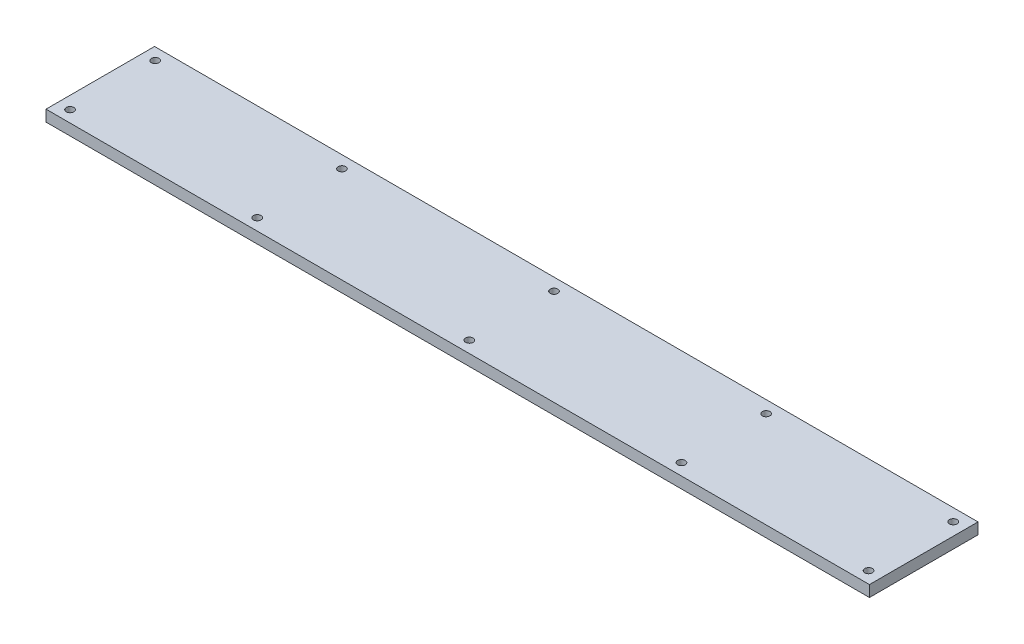
ISO-10303-21;
HEADER;
FILE_DESCRIPTION(('STEP AP214'),'2;1');
FILE_NAME('part.step','',(''),(''),'','','');
FILE_SCHEMA(('AUTOMOTIVE_DESIGN { 1 0 10303 214 1 1 1 1 }'));
ENDSEC;
DATA;
#1=APPLICATION_CONTEXT('core data for automotive mechanical design processes');
#2=APPLICATION_PROTOCOL_DEFINITION('international standard','automotive_design',2000,#1);
#3=PRODUCT_CONTEXT('',#1,'mechanical');
#4=PRODUCT('Part','Part','',(#3));
#5=PRODUCT_RELATED_PRODUCT_CATEGORY('part','',(#4));
#6=PRODUCT_DEFINITION_FORMATION('','',#4);
#7=PRODUCT_DEFINITION_CONTEXT('part definition',#1,'design');
#8=PRODUCT_DEFINITION('design','',#6,#7);
#9=PRODUCT_DEFINITION_SHAPE('','',#8);
#10=(LENGTH_UNIT() NAMED_UNIT(*) SI_UNIT(.MILLI.,.METRE.));
#11=(NAMED_UNIT(*) PLANE_ANGLE_UNIT() SI_UNIT($,.RADIAN.));
#12=(NAMED_UNIT(*) SI_UNIT($,.STERADIAN.) SOLID_ANGLE_UNIT());
#13=UNCERTAINTY_MEASURE_WITH_UNIT(LENGTH_MEASURE(1.E-05),#10,'distance_accuracy_value','');
#14=(GEOMETRIC_REPRESENTATION_CONTEXT(3) GLOBAL_UNCERTAINTY_ASSIGNED_CONTEXT((#13)) GLOBAL_UNIT_ASSIGNED_CONTEXT((#10,
#11,#12)) REPRESENTATION_CONTEXT('',''));
#15=CARTESIAN_POINT('',(0.,0.,0.));
#16=DIRECTION('',(0.,0.,1.));
#17=DIRECTION('',(1.,0.,0.));
#18=AXIS2_PLACEMENT_3D('',#15,#16,#17);
#19=CARTESIAN_POINT('',(0.,4.5,0.));
#20=DIRECTION('',(-1.,0.,0.));
#21=DIRECTION('',(0.,0.,1.));
#22=AXIS2_PLACEMENT_3D('',#19,#20,#21);
#23=PLANE('',#22);
#24=DIRECTION('',(0.,0.,-1.));
#25=VECTOR('',#24,1.);
#26=CARTESIAN_POINT('',(0.,0.,0.));
#27=LINE('',#26,#25);
#28=CARTESIAN_POINT('',(0.,0.,0.));
#29=VERTEX_POINT('',#28);
#30=CARTESIAN_POINT('',(0.,0.,-43.5));
#31=VERTEX_POINT('',#30);
#32=EDGE_CURVE('E100',#29,#31,#27,.T.);
#33=ORIENTED_EDGE('',*,*,#32,.T.);
#34=DIRECTION('',(0.,-1.,0.));
#35=VECTOR('',#34,1.);
#36=CARTESIAN_POINT('',(0.,4.5,-43.5));
#37=LINE('',#36,#35);
#38=CARTESIAN_POINT('',(0.,4.5,-43.5));
#39=VERTEX_POINT('',#38);
#40=EDGE_CURVE('E11',#39,#31,#37,.T.);
#41=ORIENTED_EDGE('',*,*,#40,.F.);
#42=DIRECTION('',(0.,0.,-1.));
#43=VECTOR('',#42,1.);
#44=CARTESIAN_POINT('',(0.,4.5,0.));
#45=LINE('',#44,#43);
#46=CARTESIAN_POINT('',(0.,4.5,0.));
#47=VERTEX_POINT('',#46);
#48=EDGE_CURVE('E88',#47,#39,#45,.T.);
#49=ORIENTED_EDGE('',*,*,#48,.F.);
#50=DIRECTION('',(0.,-1.,0.));
#51=VECTOR('',#50,1.);
#52=CARTESIAN_POINT('',(0.,4.5,0.));
#53=LINE('',#52,#51);
#54=EDGE_CURVE('E96',#47,#29,#53,.T.);
#55=ORIENTED_EDGE('',*,*,#54,.T.);
#56=EDGE_LOOP('',(#33,#41,#49,#55));
#57=FACE_BOUND('',#56,.T.);
#58=ADVANCED_FACE('F37',(#57),#23,.F.);
#59=CARTESIAN_POINT('',(0.,4.5,-43.5));
#60=DIRECTION('',(0.,0.,1.));
#61=DIRECTION('',(1.,0.,0.));
#62=AXIS2_PLACEMENT_3D('',#59,#60,#61);
#63=PLANE('',#62);
#64=DIRECTION('',(-1.,0.,0.));
#65=VECTOR('',#64,1.);
#66=CARTESIAN_POINT('',(0.,0.,-43.5));
#67=LINE('',#66,#65);
#68=CARTESIAN_POINT('',(-330.,0.,-43.5));
#69=VERTEX_POINT('',#68);
#70=EDGE_CURVE('E92',#31,#69,#67,.T.);
#71=ORIENTED_EDGE('',*,*,#70,.T.);
#72=DIRECTION('',(0.,-1.,0.));
#73=VECTOR('',#72,1.);
#74=CARTESIAN_POINT('',(-330.,4.5,-43.5));
#75=LINE('',#74,#73);
#76=CARTESIAN_POINT('',(-330.,4.5,-43.5));
#77=VERTEX_POINT('',#76);
#78=EDGE_CURVE('E45',#77,#69,#75,.T.);
#79=ORIENTED_EDGE('',*,*,#78,.F.);
#80=DIRECTION('',(-1.,0.,0.));
#81=VECTOR('',#80,1.);
#82=CARTESIAN_POINT('',(0.,4.5,-43.5));
#83=LINE('',#82,#81);
#84=EDGE_CURVE('E83',#39,#77,#83,.T.);
#85=ORIENTED_EDGE('',*,*,#84,.F.);
#86=ORIENTED_EDGE('',*,*,#40,.T.);
#87=EDGE_LOOP('',(#71,#79,#85,#86));
#88=FACE_BOUND('',#87,.T.);
#89=ADVANCED_FACE('F91',(#88),#63,.F.);
#90=CARTESIAN_POINT('',(-330.,4.5,0.));
#91=DIRECTION('',(1.,0.,0.));
#92=DIRECTION('',(0.,0.,-1.));
#93=AXIS2_PLACEMENT_3D('',#90,#91,#92);
#94=PLANE('',#93);
#95=DIRECTION('',(0.,0.,1.));
#96=VECTOR('',#95,1.);
#97=CARTESIAN_POINT('',(-330.,0.,0.));
#98=LINE('',#97,#96);
#99=CARTESIAN_POINT('',(-330.,0.,0.));
#100=VERTEX_POINT('',#99);
#101=EDGE_CURVE('E70',#69,#100,#98,.T.);
#102=ORIENTED_EDGE('',*,*,#101,.T.);
#103=DIRECTION('',(0.,-1.,0.));
#104=VECTOR('',#103,1.);
#105=CARTESIAN_POINT('',(-330.,4.5,0.));
#106=LINE('',#105,#104);
#107=CARTESIAN_POINT('',(-330.,4.5,0.));
#108=VERTEX_POINT('',#107);
#109=EDGE_CURVE('E93',#108,#100,#106,.T.);
#110=ORIENTED_EDGE('',*,*,#109,.F.);
#111=DIRECTION('',(0.,0.,1.));
#112=VECTOR('',#111,1.);
#113=CARTESIAN_POINT('',(-330.,4.5,0.));
#114=LINE('',#113,#112);
#115=EDGE_CURVE('E86',#77,#108,#114,.T.);
#116=ORIENTED_EDGE('',*,*,#115,.F.);
#117=ORIENTED_EDGE('',*,*,#78,.T.);
#118=EDGE_LOOP('',(#102,#110,#116,#117));
#119=FACE_BOUND('',#118,.T.);
#120=ADVANCED_FACE('F94',(#119),#94,.F.);
#121=CARTESIAN_POINT('',(0.,4.5,0.));
#122=DIRECTION('',(0.,0.,-1.));
#123=DIRECTION('',(-1.,0.,0.));
#124=AXIS2_PLACEMENT_3D('',#121,#122,#123);
#125=PLANE('',#124);
#126=DIRECTION('',(1.,0.,0.));
#127=VECTOR('',#126,1.);
#128=CARTESIAN_POINT('',(0.,0.,0.));
#129=LINE('',#128,#127);
#130=EDGE_CURVE('E76',#100,#29,#129,.T.);
#131=ORIENTED_EDGE('',*,*,#130,.T.);
#132=ORIENTED_EDGE('',*,*,#54,.F.);
#133=DIRECTION('',(1.,0.,0.));
#134=VECTOR('',#133,1.);
#135=CARTESIAN_POINT('',(0.,4.5,0.));
#136=LINE('',#135,#134);
#137=EDGE_CURVE('E53',#108,#47,#136,.T.);
#138=ORIENTED_EDGE('',*,*,#137,.F.);
#139=ORIENTED_EDGE('',*,*,#109,.T.);
#140=EDGE_LOOP('',(#131,#132,#138,#139));
#141=FACE_BOUND('',#140,.T.);
#142=ADVANCED_FACE('F108',(#141),#125,.F.);
#143=CARTESIAN_POINT('',(0.,4.5,0.));
#144=DIRECTION('',(0.,1.,0.));
#145=DIRECTION('',(0.,0.,1.));
#146=AXIS2_PLACEMENT_3D('',#143,#144,#145);
#147=PLANE('',#146);
#148=CARTESIAN_POINT('',(-325.,4.5,-38.75));
#149=DIRECTION('',(0.,1.,0.));
#150=DIRECTION('',(0.,0.,1.));
#151=AXIS2_PLACEMENT_3D('',#148,#149,#150);
#152=CIRCLE('',#151,1.52399999999997);
#153=CARTESIAN_POINT('',(-325.,4.5,-37.226));
#154=VERTEX_POINT('',#153);
#155=EDGE_CURVE('E170',#154,#154,#152,.T.);
#156=ORIENTED_EDGE('',*,*,#155,.F.);
#157=EDGE_LOOP('',(#156));
#158=FACE_BOUND('',#157,.T.);
#159=CARTESIAN_POINT('',(-325.,4.5,-4.6430054498532));
#160=DIRECTION('',(0.,1.,0.));
#161=DIRECTION('',(0.,0.,1.));
#162=AXIS2_PLACEMENT_3D('',#159,#160,#161);
#163=CIRCLE('',#162,1.52399999999997);
#164=CARTESIAN_POINT('',(-325.,4.5,-3.11900544985323));
#165=VERTEX_POINT('',#164);
#166=EDGE_CURVE('E164',#165,#165,#163,.T.);
#167=ORIENTED_EDGE('',*,*,#166,.F.);
#168=EDGE_LOOP('',(#167));
#169=FACE_BOUND('',#168,.T.);
#170=CARTESIAN_POINT('',(-250.,4.5,-4.6430054498532));
#171=DIRECTION('',(0.,1.,0.));
#172=DIRECTION('',(0.,0.,1.));
#173=AXIS2_PLACEMENT_3D('',#170,#171,#172);
#174=CIRCLE('',#173,1.524);
#175=CARTESIAN_POINT('',(-250.,4.5,-3.11900544985321));
#176=VERTEX_POINT('',#175);
#177=EDGE_CURVE('E158',#176,#176,#174,.T.);
#178=ORIENTED_EDGE('',*,*,#177,.F.);
#179=EDGE_LOOP('',(#178));
#180=FACE_BOUND('',#179,.T.);
#181=CARTESIAN_POINT('',(-250.,4.5,-38.59177186768));
#182=DIRECTION('',(0.,1.,0.));
#183=DIRECTION('',(0.,0.,1.));
#184=AXIS2_PLACEMENT_3D('',#181,#182,#183);
#185=CIRCLE('',#184,1.524);
#186=CARTESIAN_POINT('',(-250.,4.5,-37.06777186768));
#187=VERTEX_POINT('',#186);
#188=EDGE_CURVE('E152',#187,#187,#185,.T.);
#189=ORIENTED_EDGE('',*,*,#188,.F.);
#190=EDGE_LOOP('',(#189));
#191=FACE_BOUND('',#190,.T.);
#192=CARTESIAN_POINT('',(-165.,4.5,-38.59177186768));
#193=DIRECTION('',(0.,1.,0.));
#194=DIRECTION('',(0.,0.,1.));
#195=AXIS2_PLACEMENT_3D('',#192,#193,#194);
#196=CIRCLE('',#195,1.524);
#197=CARTESIAN_POINT('',(-165.,4.5,-37.06777186768));
#198=VERTEX_POINT('',#197);
#199=EDGE_CURVE('E146',#198,#198,#196,.T.);
#200=ORIENTED_EDGE('',*,*,#199,.F.);
#201=EDGE_LOOP('',(#200));
#202=FACE_BOUND('',#201,.T.);
#203=CARTESIAN_POINT('',(-165.,4.5,-4.6430054498532));
#204=DIRECTION('',(0.,1.,0.));
#205=DIRECTION('',(0.,0.,1.));
#206=AXIS2_PLACEMENT_3D('',#203,#204,#205);
#207=CIRCLE('',#206,1.524);
#208=CARTESIAN_POINT('',(-165.,4.5,-3.11900544985321));
#209=VERTEX_POINT('',#208);
#210=EDGE_CURVE('E140',#209,#209,#207,.T.);
#211=ORIENTED_EDGE('',*,*,#210,.F.);
#212=EDGE_LOOP('',(#211));
#213=FACE_BOUND('',#212,.T.);
#214=CARTESIAN_POINT('',(-80.,4.5,-4.6430054498532));
#215=DIRECTION('',(0.,1.,0.));
#216=DIRECTION('',(0.,0.,1.));
#217=AXIS2_PLACEMENT_3D('',#214,#215,#216);
#218=CIRCLE('',#217,1.52399999999998);
#219=CARTESIAN_POINT('',(-80.,4.5,-3.11900544985322));
#220=VERTEX_POINT('',#219);
#221=EDGE_CURVE('E134',#220,#220,#218,.T.);
#222=ORIENTED_EDGE('',*,*,#221,.F.);
#223=EDGE_LOOP('',(#222));
#224=FACE_BOUND('',#223,.T.);
#225=CARTESIAN_POINT('',(-80.,4.5,-38.59177186768));
#226=DIRECTION('',(0.,1.,0.));
#227=DIRECTION('',(0.,0.,1.));
#228=AXIS2_PLACEMENT_3D('',#225,#226,#227);
#229=CIRCLE('',#228,1.52399999999998);
#230=CARTESIAN_POINT('',(-80.,4.5,-37.06777186768));
#231=VERTEX_POINT('',#230);
#232=EDGE_CURVE('E128',#231,#231,#229,.T.);
#233=ORIENTED_EDGE('',*,*,#232,.F.);
#234=EDGE_LOOP('',(#233));
#235=FACE_BOUND('',#234,.T.);
#236=CARTESIAN_POINT('',(-5.,4.5,-38.59177186768));
#237=DIRECTION('',(0.,1.,0.));
#238=DIRECTION('',(0.,0.,1.));
#239=AXIS2_PLACEMENT_3D('',#236,#237,#238);
#240=CIRCLE('',#239,1.52399999999999);
#241=CARTESIAN_POINT('',(-5.,4.5,-37.06777186768));
#242=VERTEX_POINT('',#241);
#243=EDGE_CURVE('E122',#242,#242,#240,.T.);
#244=ORIENTED_EDGE('',*,*,#243,.F.);
#245=EDGE_LOOP('',(#244));
#246=FACE_BOUND('',#245,.T.);
#247=CARTESIAN_POINT('',(-5.,4.5,-4.6430054498532));
#248=DIRECTION('',(0.,1.,0.));
#249=DIRECTION('',(0.,0.,1.));
#250=AXIS2_PLACEMENT_3D('',#247,#248,#249);
#251=CIRCLE('',#250,1.52399999999999);
#252=CARTESIAN_POINT('',(-5.,4.5,-3.11900544985322));
#253=VERTEX_POINT('',#252);
#254=EDGE_CURVE('E116',#253,#253,#251,.T.);
#255=ORIENTED_EDGE('',*,*,#254,.F.);
#256=EDGE_LOOP('',(#255));
#257=FACE_BOUND('',#256,.T.);
#258=ORIENTED_EDGE('',*,*,#48,.T.);
#259=ORIENTED_EDGE('',*,*,#84,.T.);
#260=ORIENTED_EDGE('',*,*,#115,.T.);
#261=ORIENTED_EDGE('',*,*,#137,.T.);
#262=EDGE_LOOP('',(#258,#259,#260,#261));
#263=FACE_BOUND('',#262,.T.);
#264=ADVANCED_FACE('F84',(#158,#169,#180,#191,#202,#213,#224,#235,#246,#257,#263),#147,.T.);
#265=CARTESIAN_POINT('',(0.,0.,0.));
#266=DIRECTION('',(0.,1.,0.));
#267=DIRECTION('',(0.,0.,1.));
#268=AXIS2_PLACEMENT_3D('',#265,#266,#267);
#269=PLANE('',#268);
#270=CARTESIAN_POINT('',(-325.,0.,-38.75));
#271=DIRECTION('',(0.,1.,0.));
#272=DIRECTION('',(0.,0.,1.));
#273=AXIS2_PLACEMENT_3D('',#270,#271,#272);
#274=CIRCLE('',#273,1.52400000000003);
#275=CARTESIAN_POINT('',(-325.,0.,-37.2259999999999));
#276=VERTEX_POINT('',#275);
#277=EDGE_CURVE('E167',#276,#276,#274,.T.);
#278=ORIENTED_EDGE('',*,*,#277,.T.);
#279=EDGE_LOOP('',(#278));
#280=FACE_BOUND('',#279,.T.);
#281=CARTESIAN_POINT('',(-325.,0.,-4.6430054498532));
#282=DIRECTION('',(0.,1.,0.));
#283=DIRECTION('',(0.,0.,1.));
#284=AXIS2_PLACEMENT_3D('',#281,#282,#283);
#285=CIRCLE('',#284,1.52400000000003);
#286=CARTESIAN_POINT('',(-325.,0.,-3.11900544985318));
#287=VERTEX_POINT('',#286);
#288=EDGE_CURVE('E161',#287,#287,#285,.T.);
#289=ORIENTED_EDGE('',*,*,#288,.T.);
#290=EDGE_LOOP('',(#289));
#291=FACE_BOUND('',#290,.T.);
#292=CARTESIAN_POINT('',(-250.,0.,-4.6430054498532));
#293=DIRECTION('',(0.,1.,0.));
#294=DIRECTION('',(0.,0.,1.));
#295=AXIS2_PLACEMENT_3D('',#292,#293,#294);
#296=CIRCLE('',#295,1.524);
#297=CARTESIAN_POINT('',(-250.,0.,-3.11900544985321));
#298=VERTEX_POINT('',#297);
#299=EDGE_CURVE('E155',#298,#298,#296,.T.);
#300=ORIENTED_EDGE('',*,*,#299,.T.);
#301=EDGE_LOOP('',(#300));
#302=FACE_BOUND('',#301,.T.);
#303=CARTESIAN_POINT('',(-250.,0.,-38.59177186768));
#304=DIRECTION('',(0.,1.,0.));
#305=DIRECTION('',(0.,0.,1.));
#306=AXIS2_PLACEMENT_3D('',#303,#304,#305);
#307=CIRCLE('',#306,1.524);
#308=CARTESIAN_POINT('',(-250.,0.,-37.06777186768));
#309=VERTEX_POINT('',#308);
#310=EDGE_CURVE('E149',#309,#309,#307,.T.);
#311=ORIENTED_EDGE('',*,*,#310,.T.);
#312=EDGE_LOOP('',(#311));
#313=FACE_BOUND('',#312,.T.);
#314=CARTESIAN_POINT('',(-165.,0.,-38.59177186768));
#315=DIRECTION('',(0.,1.,0.));
#316=DIRECTION('',(0.,0.,1.));
#317=AXIS2_PLACEMENT_3D('',#314,#315,#316);
#318=CIRCLE('',#317,1.524);
#319=CARTESIAN_POINT('',(-165.,0.,-37.06777186768));
#320=VERTEX_POINT('',#319);
#321=EDGE_CURVE('E143',#320,#320,#318,.T.);
#322=ORIENTED_EDGE('',*,*,#321,.T.);
#323=EDGE_LOOP('',(#322));
#324=FACE_BOUND('',#323,.T.);
#325=CARTESIAN_POINT('',(-165.,0.,-4.6430054498532));
#326=DIRECTION('',(0.,1.,0.));
#327=DIRECTION('',(0.,0.,1.));
#328=AXIS2_PLACEMENT_3D('',#325,#326,#327);
#329=CIRCLE('',#328,1.524);
#330=CARTESIAN_POINT('',(-165.,0.,-3.11900544985321));
#331=VERTEX_POINT('',#330);
#332=EDGE_CURVE('E137',#331,#331,#329,.T.);
#333=ORIENTED_EDGE('',*,*,#332,.T.);
#334=EDGE_LOOP('',(#333));
#335=FACE_BOUND('',#334,.T.);
#336=CARTESIAN_POINT('',(-80.,0.,-4.6430054498532));
#337=DIRECTION('',(0.,1.,0.));
#338=DIRECTION('',(0.,0.,1.));
#339=AXIS2_PLACEMENT_3D('',#336,#337,#338);
#340=CIRCLE('',#339,1.524);
#341=CARTESIAN_POINT('',(-80.,0.,-3.11900544985321));
#342=VERTEX_POINT('',#341);
#343=EDGE_CURVE('E131',#342,#342,#340,.T.);
#344=ORIENTED_EDGE('',*,*,#343,.T.);
#345=EDGE_LOOP('',(#344));
#346=FACE_BOUND('',#345,.T.);
#347=CARTESIAN_POINT('',(-80.,0.,-38.59177186768));
#348=DIRECTION('',(0.,1.,0.));
#349=DIRECTION('',(0.,0.,1.));
#350=AXIS2_PLACEMENT_3D('',#347,#348,#349);
#351=CIRCLE('',#350,1.524);
#352=CARTESIAN_POINT('',(-80.,0.,-37.06777186768));
#353=VERTEX_POINT('',#352);
#354=EDGE_CURVE('E125',#353,#353,#351,.T.);
#355=ORIENTED_EDGE('',*,*,#354,.T.);
#356=EDGE_LOOP('',(#355));
#357=FACE_BOUND('',#356,.T.);
#358=CARTESIAN_POINT('',(-5.,0.,-38.59177186768));
#359=DIRECTION('',(0.,1.,0.));
#360=DIRECTION('',(0.,0.,1.));
#361=AXIS2_PLACEMENT_3D('',#358,#359,#360);
#362=CIRCLE('',#361,1.524);
#363=CARTESIAN_POINT('',(-5.,0.,-37.06777186768));
#364=VERTEX_POINT('',#363);
#365=EDGE_CURVE('E119',#364,#364,#362,.T.);
#366=ORIENTED_EDGE('',*,*,#365,.T.);
#367=EDGE_LOOP('',(#366));
#368=FACE_BOUND('',#367,.T.);
#369=CARTESIAN_POINT('',(-5.,0.,-4.6430054498532));
#370=DIRECTION('',(0.,1.,0.));
#371=DIRECTION('',(0.,0.,1.));
#372=AXIS2_PLACEMENT_3D('',#369,#370,#371);
#373=CIRCLE('',#372,1.524);
#374=CARTESIAN_POINT('',(-5.,0.,-3.11900544985321));
#375=VERTEX_POINT('',#374);
#376=EDGE_CURVE('E103',#375,#375,#373,.T.);
#377=ORIENTED_EDGE('',*,*,#376,.T.);
#378=EDGE_LOOP('',(#377));
#379=FACE_BOUND('',#378,.T.);
#380=ORIENTED_EDGE('',*,*,#32,.F.);
#381=ORIENTED_EDGE('',*,*,#130,.F.);
#382=ORIENTED_EDGE('',*,*,#101,.F.);
#383=ORIENTED_EDGE('',*,*,#70,.F.);
#384=EDGE_LOOP('',(#380,#381,#382,#383));
#385=FACE_BOUND('',#384,.T.);
#386=ADVANCED_FACE('F111',(#280,#291,#302,#313,#324,#335,#346,#357,#368,#379,#385),#269,.F.);
#387=CARTESIAN_POINT('',(-5.,4.5,-4.6430054498532));
#388=DIRECTION('',(0.,1.,0.));
#389=DIRECTION('',(0.,0.,1.));
#390=AXIS2_PLACEMENT_3D('',#387,#388,#389);
#391=CYLINDRICAL_SURFACE('',#390,1.52399999999999);
#392=ORIENTED_EDGE('',*,*,#376,.F.);
#393=EDGE_LOOP('',(#392));
#394=FACE_BOUND('',#393,.T.);
#395=ORIENTED_EDGE('',*,*,#254,.T.);
#396=EDGE_LOOP('',(#395));
#397=FACE_BOUND('',#396,.T.);
#398=ADVANCED_FACE('F197',(#394,#397),#391,.F.);
#399=CARTESIAN_POINT('',(-5.,4.5,-38.59177186768));
#400=DIRECTION('',(0.,1.,0.));
#401=DIRECTION('',(0.,0.,1.));
#402=AXIS2_PLACEMENT_3D('',#399,#400,#401);
#403=CYLINDRICAL_SURFACE('',#402,1.52399999999999);
#404=ORIENTED_EDGE('',*,*,#365,.F.);
#405=EDGE_LOOP('',(#404));
#406=FACE_BOUND('',#405,.T.);
#407=ORIENTED_EDGE('',*,*,#243,.T.);
#408=EDGE_LOOP('',(#407));
#409=FACE_BOUND('',#408,.T.);
#410=ADVANCED_FACE('F199',(#406,#409),#403,.F.);
#411=CARTESIAN_POINT('',(-80.,4.5,-38.59177186768));
#412=DIRECTION('',(0.,1.,0.));
#413=DIRECTION('',(0.,0.,1.));
#414=AXIS2_PLACEMENT_3D('',#411,#412,#413);
#415=CYLINDRICAL_SURFACE('',#414,1.52399999999999);
#416=ORIENTED_EDGE('',*,*,#354,.F.);
#417=EDGE_LOOP('',(#416));
#418=FACE_BOUND('',#417,.T.);
#419=ORIENTED_EDGE('',*,*,#232,.T.);
#420=EDGE_LOOP('',(#419));
#421=FACE_BOUND('',#420,.T.);
#422=ADVANCED_FACE('F206',(#418,#421),#415,.F.);
#423=CARTESIAN_POINT('',(-80.,4.5,-4.6430054498532));
#424=DIRECTION('',(0.,1.,0.));
#425=DIRECTION('',(0.,0.,1.));
#426=AXIS2_PLACEMENT_3D('',#423,#424,#425);
#427=CYLINDRICAL_SURFACE('',#426,1.52399999999999);
#428=ORIENTED_EDGE('',*,*,#343,.F.);
#429=EDGE_LOOP('',(#428));
#430=FACE_BOUND('',#429,.T.);
#431=ORIENTED_EDGE('',*,*,#221,.T.);
#432=EDGE_LOOP('',(#431));
#433=FACE_BOUND('',#432,.T.);
#434=ADVANCED_FACE('F253',(#430,#433),#427,.F.);
#435=CARTESIAN_POINT('',(-165.,4.5,-4.6430054498532));
#436=DIRECTION('',(0.,1.,0.));
#437=DIRECTION('',(0.,0.,1.));
#438=AXIS2_PLACEMENT_3D('',#435,#436,#437);
#439=CYLINDRICAL_SURFACE('',#438,1.524);
#440=ORIENTED_EDGE('',*,*,#332,.F.);
#441=EDGE_LOOP('',(#440));
#442=FACE_BOUND('',#441,.T.);
#443=ORIENTED_EDGE('',*,*,#210,.T.);
#444=EDGE_LOOP('',(#443));
#445=FACE_BOUND('',#444,.T.);
#446=ADVANCED_FACE('F263',(#442,#445),#439,.F.);
#447=CARTESIAN_POINT('',(-165.,4.5,-38.59177186768));
#448=DIRECTION('',(0.,1.,0.));
#449=DIRECTION('',(0.,0.,1.));
#450=AXIS2_PLACEMENT_3D('',#447,#448,#449);
#451=CYLINDRICAL_SURFACE('',#450,1.524);
#452=ORIENTED_EDGE('',*,*,#321,.F.);
#453=EDGE_LOOP('',(#452));
#454=FACE_BOUND('',#453,.T.);
#455=ORIENTED_EDGE('',*,*,#199,.T.);
#456=EDGE_LOOP('',(#455));
#457=FACE_BOUND('',#456,.T.);
#458=ADVANCED_FACE('F273',(#454,#457),#451,.F.);
#459=CARTESIAN_POINT('',(-250.,4.5,-38.59177186768));
#460=DIRECTION('',(0.,1.,0.));
#461=DIRECTION('',(0.,0.,1.));
#462=AXIS2_PLACEMENT_3D('',#459,#460,#461);
#463=CYLINDRICAL_SURFACE('',#462,1.524);
#464=ORIENTED_EDGE('',*,*,#310,.F.);
#465=EDGE_LOOP('',(#464));
#466=FACE_BOUND('',#465,.T.);
#467=ORIENTED_EDGE('',*,*,#188,.T.);
#468=EDGE_LOOP('',(#467));
#469=FACE_BOUND('',#468,.T.);
#470=ADVANCED_FACE('F283',(#466,#469),#463,.F.);
#471=CARTESIAN_POINT('',(-250.,4.5,-4.6430054498532));
#472=DIRECTION('',(0.,1.,0.));
#473=DIRECTION('',(0.,0.,1.));
#474=AXIS2_PLACEMENT_3D('',#471,#472,#473);
#475=CYLINDRICAL_SURFACE('',#474,1.524);
#476=ORIENTED_EDGE('',*,*,#299,.F.);
#477=EDGE_LOOP('',(#476));
#478=FACE_BOUND('',#477,.T.);
#479=ORIENTED_EDGE('',*,*,#177,.T.);
#480=EDGE_LOOP('',(#479));
#481=FACE_BOUND('',#480,.T.);
#482=ADVANCED_FACE('F293',(#478,#481),#475,.F.);
#483=CARTESIAN_POINT('',(-325.,4.5,-4.6430054498532));
#484=DIRECTION('',(0.,1.,0.));
#485=DIRECTION('',(0.,0.,1.));
#486=AXIS2_PLACEMENT_3D('',#483,#484,#485);
#487=CYLINDRICAL_SURFACE('',#486,1.524);
#488=ORIENTED_EDGE('',*,*,#288,.F.);
#489=EDGE_LOOP('',(#488));
#490=FACE_BOUND('',#489,.T.);
#491=ORIENTED_EDGE('',*,*,#166,.T.);
#492=EDGE_LOOP('',(#491));
#493=FACE_BOUND('',#492,.T.);
#494=ADVANCED_FACE('F303',(#490,#493),#487,.F.);
#495=CARTESIAN_POINT('',(-325.,4.5,-38.75));
#496=DIRECTION('',(0.,1.,0.));
#497=DIRECTION('',(0.,0.,1.));
#498=AXIS2_PLACEMENT_3D('',#495,#496,#497);
#499=CYLINDRICAL_SURFACE('',#498,1.524);
#500=ORIENTED_EDGE('',*,*,#277,.F.);
#501=EDGE_LOOP('',(#500));
#502=FACE_BOUND('',#501,.T.);
#503=ORIENTED_EDGE('',*,*,#155,.T.);
#504=EDGE_LOOP('',(#503));
#505=FACE_BOUND('',#504,.T.);
#506=ADVANCED_FACE('F174',(#502,#505),#499,.F.);
#507=CLOSED_SHELL('',(#58,#89,#120,#142,#264,#386,#398,#410,#422,#434,#446,#458,#470,#482,#494,#506));
#508=MANIFOLD_SOLID_BREP('B2',#507);
#509=ADVANCED_BREP_SHAPE_REPRESENTATION('',(#18,#508),#14);
#510=SHAPE_DEFINITION_REPRESENTATION(#9,#509);
ENDSEC;
END-ISO-10303-21;
